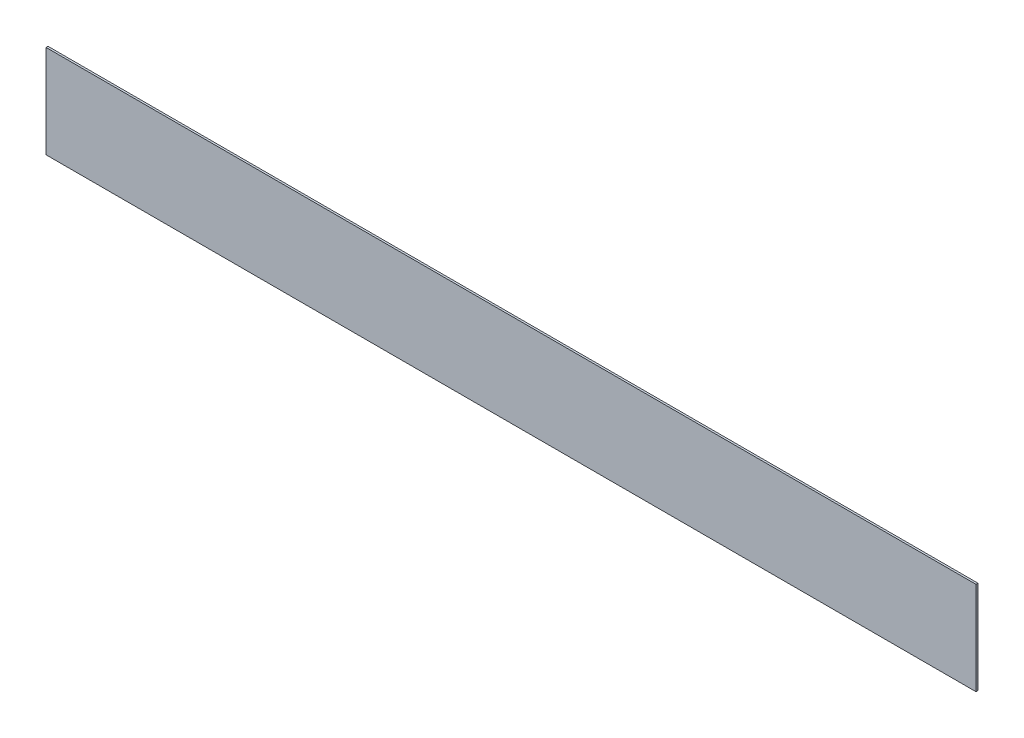
ISO-10303-21;
HEADER;
FILE_DESCRIPTION(('STEP AP214'),'2;1');
FILE_NAME('part.step','',(''),(''),'','','');
FILE_SCHEMA(('AUTOMOTIVE_DESIGN { 1 0 10303 214 1 1 1 1 }'));
ENDSEC;
DATA;
#1=APPLICATION_CONTEXT('core data for automotive mechanical design processes');
#2=APPLICATION_PROTOCOL_DEFINITION('international standard','automotive_design',2000,#1);
#3=PRODUCT_CONTEXT('',#1,'mechanical');
#4=PRODUCT('Part','Part','',(#3));
#5=PRODUCT_RELATED_PRODUCT_CATEGORY('part','',(#4));
#6=PRODUCT_DEFINITION_FORMATION('','',#4);
#7=PRODUCT_DEFINITION_CONTEXT('part definition',#1,'design');
#8=PRODUCT_DEFINITION('design','',#6,#7);
#9=PRODUCT_DEFINITION_SHAPE('','',#8);
#10=(LENGTH_UNIT() NAMED_UNIT(*) SI_UNIT(.MILLI.,.METRE.));
#11=(NAMED_UNIT(*) PLANE_ANGLE_UNIT() SI_UNIT($,.RADIAN.));
#12=(NAMED_UNIT(*) SI_UNIT($,.STERADIAN.) SOLID_ANGLE_UNIT());
#13=UNCERTAINTY_MEASURE_WITH_UNIT(LENGTH_MEASURE(1.E-05),#10,'distance_accuracy_value','');
#14=(GEOMETRIC_REPRESENTATION_CONTEXT(3) GLOBAL_UNCERTAINTY_ASSIGNED_CONTEXT((#13)) GLOBAL_UNIT_ASSIGNED_CONTEXT((#10,
#11,#12)) REPRESENTATION_CONTEXT('',''));
#15=CARTESIAN_POINT('',(0.,0.,0.));
#16=DIRECTION('',(0.,0.,1.));
#17=DIRECTION('',(1.,0.,0.));
#18=AXIS2_PLACEMENT_3D('',#15,#16,#17);
#19=CARTESIAN_POINT('',(0.,0.,0.085));
#20=DIRECTION('',(0.,0.,1.));
#21=DIRECTION('',(1.,0.,0.));
#22=AXIS2_PLACEMENT_3D('',#19,#20,#21);
#23=PLANE('',#22);
#24=DIRECTION('',(1.,0.,0.));
#25=VECTOR('',#24,1.);
#26=CARTESIAN_POINT('',(20.,2.,0.085));
#27=LINE('',#26,#25);
#28=CARTESIAN_POINT('',(-20.,2.,0.085));
#29=VERTEX_POINT('',#28);
#30=CARTESIAN_POINT('',(20.,2.,0.085));
#31=VERTEX_POINT('',#30);
#32=EDGE_CURVE('E67',#29,#31,#27,.T.);
#33=ORIENTED_EDGE('',*,*,#32,.F.);
#34=DIRECTION('',(0.,1.,0.));
#35=VECTOR('',#34,1.);
#36=CARTESIAN_POINT('',(-20.,2.,0.085));
#37=LINE('',#36,#35);
#38=CARTESIAN_POINT('',(-20.,-2.,0.085));
#39=VERTEX_POINT('',#38);
#40=EDGE_CURVE('E19',#39,#29,#37,.T.);
#41=ORIENTED_EDGE('',*,*,#40,.F.);
#42=DIRECTION('',(1.,0.,0.));
#43=VECTOR('',#42,1.);
#44=CARTESIAN_POINT('',(-20.,-2.,0.085));
#45=LINE('',#44,#43);
#46=CARTESIAN_POINT('',(20.,-2.,0.085));
#47=VERTEX_POINT('',#46);
#48=EDGE_CURVE('E57',#47,#39,#45,.F.);
#49=ORIENTED_EDGE('',*,*,#48,.F.);
#50=DIRECTION('',(0.,1.,0.));
#51=VECTOR('',#50,1.);
#52=CARTESIAN_POINT('',(20.,-2.,0.085));
#53=LINE('',#52,#51);
#54=EDGE_CURVE('E52',#31,#47,#53,.F.);
#55=ORIENTED_EDGE('',*,*,#54,.F.);
#56=EDGE_LOOP('',(#33,#41,#49,#55));
#57=FACE_BOUND('',#56,.T.);
#58=ADVANCED_FACE('F16',(#57),#23,.T.);
#59=CARTESIAN_POINT('',(-20.,2.,0.));
#60=DIRECTION('',(-1.,0.,0.));
#61=DIRECTION('',(0.,0.,1.));
#62=AXIS2_PLACEMENT_3D('',#59,#60,#61);
#63=PLANE('',#62);
#64=DIRECTION('',(0.,0.,1.));
#65=VECTOR('',#64,1.);
#66=CARTESIAN_POINT('',(-20.,2.,0.));
#67=LINE('',#66,#65);
#68=CARTESIAN_POINT('',(-20.,2.,0.));
#69=VERTEX_POINT('',#68);
#70=EDGE_CURVE('E78',#69,#29,#67,.T.);
#71=ORIENTED_EDGE('',*,*,#70,.F.);
#72=DIRECTION('',(0.,1.,0.));
#73=VECTOR('',#72,1.);
#74=CARTESIAN_POINT('',(-20.,0.,0.));
#75=LINE('',#74,#73);
#76=CARTESIAN_POINT('',(-20.,-2.,0.));
#77=VERTEX_POINT('',#76);
#78=EDGE_CURVE('E73',#69,#77,#75,.F.);
#79=ORIENTED_EDGE('',*,*,#78,.T.);
#80=DIRECTION('',(0.,0.,-1.));
#81=VECTOR('',#80,1.);
#82=CARTESIAN_POINT('',(-20.,-2.,0.));
#83=LINE('',#82,#81);
#84=EDGE_CURVE('E62',#39,#77,#83,.T.);
#85=ORIENTED_EDGE('',*,*,#84,.F.);
#86=ORIENTED_EDGE('',*,*,#40,.T.);
#87=EDGE_LOOP('',(#71,#79,#85,#86));
#88=FACE_BOUND('',#87,.T.);
#89=ADVANCED_FACE('F72',(#88),#63,.T.);
#90=CARTESIAN_POINT('',(-20.,-2.,0.));
#91=DIRECTION('',(0.,-1.,0.));
#92=DIRECTION('',(0.,0.,-1.));
#93=AXIS2_PLACEMENT_3D('',#90,#91,#92);
#94=PLANE('',#93);
#95=ORIENTED_EDGE('',*,*,#84,.T.);
#96=DIRECTION('',(1.,0.,0.));
#97=VECTOR('',#96,1.);
#98=CARTESIAN_POINT('',(0.,-2.,0.));
#99=LINE('',#98,#97);
#100=CARTESIAN_POINT('',(20.,-2.,0.));
#101=VERTEX_POINT('',#100);
#102=EDGE_CURVE('E83',#77,#101,#99,.T.);
#103=ORIENTED_EDGE('',*,*,#102,.T.);
#104=DIRECTION('',(0.,0.,-1.));
#105=VECTOR('',#104,1.);
#106=CARTESIAN_POINT('',(20.,-2.,0.));
#107=LINE('',#106,#105);
#108=EDGE_CURVE('E64',#47,#101,#107,.T.);
#109=ORIENTED_EDGE('',*,*,#108,.F.);
#110=ORIENTED_EDGE('',*,*,#48,.T.);
#111=EDGE_LOOP('',(#95,#103,#109,#110));
#112=FACE_BOUND('',#111,.T.);
#113=ADVANCED_FACE('F59',(#112),#94,.T.);
#114=CARTESIAN_POINT('',(20.,-2.,0.));
#115=DIRECTION('',(1.,0.,0.));
#116=DIRECTION('',(0.,0.,-1.));
#117=AXIS2_PLACEMENT_3D('',#114,#115,#116);
#118=PLANE('',#117);
#119=ORIENTED_EDGE('',*,*,#108,.T.);
#120=DIRECTION('',(0.,1.,0.));
#121=VECTOR('',#120,1.);
#122=CARTESIAN_POINT('',(20.,0.,0.));
#123=LINE('',#122,#121);
#124=CARTESIAN_POINT('',(20.,2.,0.));
#125=VERTEX_POINT('',#124);
#126=EDGE_CURVE('E25',#101,#125,#123,.T.);
#127=ORIENTED_EDGE('',*,*,#126,.T.);
#128=DIRECTION('',(0.,0.,1.));
#129=VECTOR('',#128,1.);
#130=CARTESIAN_POINT('',(20.,2.,0.));
#131=LINE('',#130,#129);
#132=EDGE_CURVE('E33',#31,#125,#131,.F.);
#133=ORIENTED_EDGE('',*,*,#132,.F.);
#134=ORIENTED_EDGE('',*,*,#54,.T.);
#135=EDGE_LOOP('',(#119,#127,#133,#134));
#136=FACE_BOUND('',#135,.T.);
#137=ADVANCED_FACE('F87',(#136),#118,.T.);
#138=CARTESIAN_POINT('',(20.,2.,0.));
#139=DIRECTION('',(0.,1.,0.));
#140=DIRECTION('',(0.,0.,1.));
#141=AXIS2_PLACEMENT_3D('',#138,#139,#140);
#142=PLANE('',#141);
#143=ORIENTED_EDGE('',*,*,#132,.T.);
#144=DIRECTION('',(1.,0.,0.));
#145=VECTOR('',#144,1.);
#146=CARTESIAN_POINT('',(0.,2.,0.));
#147=LINE('',#146,#145);
#148=EDGE_CURVE('E10',#125,#69,#147,.F.);
#149=ORIENTED_EDGE('',*,*,#148,.T.);
#150=ORIENTED_EDGE('',*,*,#70,.T.);
#151=ORIENTED_EDGE('',*,*,#32,.T.);
#152=EDGE_LOOP('',(#143,#149,#150,#151));
#153=FACE_BOUND('',#152,.T.);
#154=ADVANCED_FACE('F90',(#153),#142,.T.);
#155=CARTESIAN_POINT('',(0.,0.,0.));
#156=DIRECTION('',(0.,0.,1.));
#157=DIRECTION('',(1.,0.,0.));
#158=AXIS2_PLACEMENT_3D('',#155,#156,#157);
#159=PLANE('',#158);
#160=ORIENTED_EDGE('',*,*,#126,.F.);
#161=ORIENTED_EDGE('',*,*,#102,.F.);
#162=ORIENTED_EDGE('',*,*,#78,.F.);
#163=ORIENTED_EDGE('',*,*,#148,.F.);
#164=EDGE_LOOP('',(#160,#161,#162,#163));
#165=FACE_BOUND('',#164,.T.);
#166=ADVANCED_FACE('F89',(#165),#159,.F.);
#167=CLOSED_SHELL('',(#58,#89,#113,#137,#154,#166));
#168=MANIFOLD_SOLID_BREP('B1',#167);
#169=ADVANCED_BREP_SHAPE_REPRESENTATION('',(#18,#168),#14);
#170=SHAPE_DEFINITION_REPRESENTATION(#9,#169);
ENDSEC;
END-ISO-10303-21;
